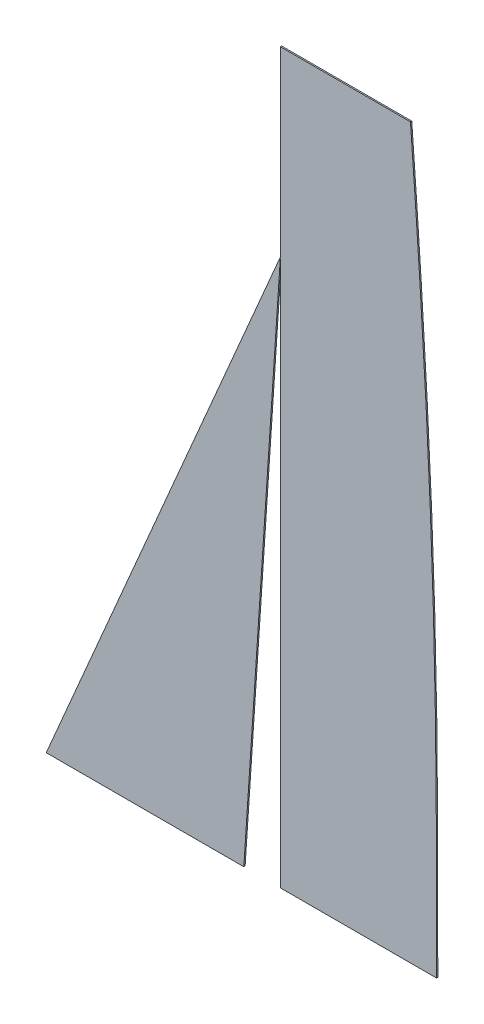
ISO-10303-21;
HEADER;
FILE_DESCRIPTION(('STEP AP214'),'2;1');
FILE_NAME('part.step','',(''),(''),'','','');
FILE_SCHEMA(('AUTOMOTIVE_DESIGN { 1 0 10303 214 1 1 1 1 }'));
ENDSEC;
DATA;
#1=APPLICATION_CONTEXT('core data for automotive mechanical design processes');
#2=APPLICATION_PROTOCOL_DEFINITION('international standard','automotive_design',2000,#1);
#3=PRODUCT_CONTEXT('',#1,'mechanical');
#4=PRODUCT('Part','Part','',(#3));
#5=PRODUCT_RELATED_PRODUCT_CATEGORY('part','',(#4));
#6=PRODUCT_DEFINITION_FORMATION('','',#4);
#7=PRODUCT_DEFINITION_CONTEXT('part definition',#1,'design');
#8=PRODUCT_DEFINITION('design','',#6,#7);
#9=PRODUCT_DEFINITION_SHAPE('','',#8);
#10=(LENGTH_UNIT() NAMED_UNIT(*) SI_UNIT(.MILLI.,.METRE.));
#11=(NAMED_UNIT(*) PLANE_ANGLE_UNIT() SI_UNIT($,.RADIAN.));
#12=(NAMED_UNIT(*) SI_UNIT($,.STERADIAN.) SOLID_ANGLE_UNIT());
#13=UNCERTAINTY_MEASURE_WITH_UNIT(LENGTH_MEASURE(1.E-05),#10,'distance_accuracy_value','');
#14=(GEOMETRIC_REPRESENTATION_CONTEXT(3) GLOBAL_UNCERTAINTY_ASSIGNED_CONTEXT((#13)) GLOBAL_UNIT_ASSIGNED_CONTEXT((#10,
#11,#12)) REPRESENTATION_CONTEXT('',''));
#15=CARTESIAN_POINT('',(0.,0.,0.));
#16=DIRECTION('',(0.,0.,1.));
#17=DIRECTION('',(1.,0.,0.));
#18=AXIS2_PLACEMENT_3D('',#15,#16,#17);
#19=CARTESIAN_POINT('',(-71.0554669763056,4.75391743362067,2.54));
#20=DIRECTION('',(0.997769391911804,-0.0667550789374777,0.));
#21=DIRECTION('',(0.0667550789374777,0.997769391911804,0.));
#22=AXIS2_PLACEMENT_3D('',#19,#20,#21);
#23=PLANE('',#22);
#24=DIRECTION('',(-0.0667550789374777,-0.997769391911804,0.));
#25=VECTOR('',#24,1.);
#26=CARTESIAN_POINT('',(-71.0554669763056,4.75391743362067,0.));
#27=LINE('',#26,#25);
#28=CARTESIAN_POINT('',(-1.3064532053304E-13,1066.8,0.));
#29=VERTEX_POINT('',#28);
#30=CARTESIAN_POINT('',(-71.373524571694,0.,0.));
#31=VERTEX_POINT('',#30);
#32=EDGE_CURVE('E95',#29,#31,#27,.T.);
#33=ORIENTED_EDGE('',*,*,#32,.F.);
#34=DIRECTION('',(0.,0.,-1.));
#35=VECTOR('',#34,1.);
#36=CARTESIAN_POINT('',(-1.3064532053304E-13,1066.8,2.54));
#37=LINE('',#36,#35);
#38=CARTESIAN_POINT('',(-1.3064532053304E-13,1066.8,2.54));
#39=VERTEX_POINT('',#38);
#40=EDGE_CURVE('E12',#39,#29,#37,.T.);
#41=ORIENTED_EDGE('',*,*,#40,.F.);
#42=DIRECTION('',(-0.0667550789374777,-0.997769391911804,0.));
#43=VECTOR('',#42,1.);
#44=CARTESIAN_POINT('',(-71.0554669763056,4.75391743362067,2.54));
#45=LINE('',#44,#43);
#46=CARTESIAN_POINT('',(-71.373524571694,0.,2.54));
#47=VERTEX_POINT('',#46);
#48=EDGE_CURVE('E93',#39,#47,#45,.T.);
#49=ORIENTED_EDGE('',*,*,#48,.T.);
#50=DIRECTION('',(0.,0.,-1.));
#51=VECTOR('',#50,1.);
#52=CARTESIAN_POINT('',(-71.373524571694,0.,2.54));
#53=LINE('',#52,#51);
#54=EDGE_CURVE('E88',#47,#31,#53,.T.);
#55=ORIENTED_EDGE('',*,*,#54,.T.);
#56=EDGE_LOOP('',(#33,#41,#49,#55));
#57=FACE_BOUND('',#56,.T.);
#58=ADVANCED_FACE('F48',(#57),#23,.T.);
#59=CARTESIAN_POINT('',(-386.255172413793,165.537931034483,2.54));
#60=DIRECTION('',(0.919145030018058,-0.393919298579168,0.));
#61=DIRECTION('',(0.393919298579168,0.919145030018058,0.));
#62=AXIS2_PLACEMENT_3D('',#59,#60,#61);
#63=PLANE('',#62);
#64=DIRECTION('',(-0.393919298579168,-0.919145030018058,0.));
#65=VECTOR('',#64,1.);
#66=CARTESIAN_POINT('',(-386.255172413793,165.537931034483,0.));
#67=LINE('',#66,#65);
#68=CARTESIAN_POINT('',(-457.2,0.,0.));
#69=VERTEX_POINT('',#68);
#70=EDGE_CURVE('E82',#29,#69,#67,.T.);
#71=ORIENTED_EDGE('',*,*,#70,.T.);
#72=DIRECTION('',(0.,0.,-1.));
#73=VECTOR('',#72,1.);
#74=CARTESIAN_POINT('',(-457.2,0.,2.54));
#75=LINE('',#74,#73);
#76=CARTESIAN_POINT('',(-457.2,0.,2.54));
#77=VERTEX_POINT('',#76);
#78=EDGE_CURVE('E57',#77,#69,#75,.T.);
#79=ORIENTED_EDGE('',*,*,#78,.F.);
#80=DIRECTION('',(-0.393919298579168,-0.919145030018058,0.));
#81=VECTOR('',#80,1.);
#82=CARTESIAN_POINT('',(-386.255172413793,165.537931034483,2.54));
#83=LINE('',#82,#81);
#84=EDGE_CURVE('E96',#39,#77,#83,.T.);
#85=ORIENTED_EDGE('',*,*,#84,.F.);
#86=ORIENTED_EDGE('',*,*,#40,.T.);
#87=EDGE_LOOP('',(#71,#79,#85,#86));
#88=FACE_BOUND('',#87,.T.);
#89=ADVANCED_FACE('F97',(#88),#63,.F.);
#90=CARTESIAN_POINT('',(0.,0.,2.54));
#91=DIRECTION('',(0.,1.,0.));
#92=DIRECTION('',(0.,0.,1.));
#93=AXIS2_PLACEMENT_3D('',#90,#91,#92);
#94=PLANE('',#93);
#95=DIRECTION('',(1.,0.,0.));
#96=VECTOR('',#95,1.);
#97=CARTESIAN_POINT('',(0.,0.,0.));
#98=LINE('',#97,#96);
#99=EDGE_CURVE('E102',#69,#31,#98,.T.);
#100=ORIENTED_EDGE('',*,*,#99,.T.);
#101=ORIENTED_EDGE('',*,*,#54,.F.);
#102=DIRECTION('',(1.,0.,0.));
#103=VECTOR('',#102,1.);
#104=CARTESIAN_POINT('',(0.,0.,2.54));
#105=LINE('',#104,#103);
#106=EDGE_CURVE('E67',#77,#47,#105,.T.);
#107=ORIENTED_EDGE('',*,*,#106,.F.);
#108=ORIENTED_EDGE('',*,*,#78,.T.);
#109=EDGE_LOOP('',(#100,#101,#107,#108));
#110=FACE_BOUND('',#109,.T.);
#111=ADVANCED_FACE('F117',(#110),#94,.F.);
#112=CARTESIAN_POINT('',(0.,0.,2.54));
#113=DIRECTION('',(0.,0.,1.));
#114=DIRECTION('',(1.,0.,0.));
#115=AXIS2_PLACEMENT_3D('',#112,#113,#114);
#116=PLANE('',#115);
#117=ORIENTED_EDGE('',*,*,#48,.F.);
#118=ORIENTED_EDGE('',*,*,#84,.T.);
#119=ORIENTED_EDGE('',*,*,#106,.T.);
#120=EDGE_LOOP('',(#117,#118,#119));
#121=FACE_BOUND('',#120,.T.);
#122=ADVANCED_FACE('F100',(#121),#116,.T.);
#123=CARTESIAN_POINT('',(0.,0.,0.));
#124=DIRECTION('',(0.,0.,1.));
#125=DIRECTION('',(1.,0.,0.));
#126=AXIS2_PLACEMENT_3D('',#123,#124,#125);
#127=PLANE('',#126);
#128=ORIENTED_EDGE('',*,*,#32,.T.);
#129=ORIENTED_EDGE('',*,*,#99,.F.);
#130=ORIENTED_EDGE('',*,*,#70,.F.);
#131=EDGE_LOOP('',(#128,#129,#130));
#132=FACE_BOUND('',#131,.T.);
#133=ADVANCED_FACE('F119',(#132),#127,.F.);
#134=CLOSED_SHELL('',(#58,#89,#111,#122,#133));
#135=MANIFOLD_SOLID_BREP('B2',#134);
#136=CARTESIAN_POINT('',(304.8,0.,2.54));
#137=DIRECTION('',(0.,1.,0.));
#138=DIRECTION('',(-1.,0.,0.));
#139=AXIS2_PLACEMENT_3D('',#136,#137,#138);
#140=PLANE('',#139);
#141=DIRECTION('',(1.,0.,0.));
#142=VECTOR('',#141,1.);
#143=CARTESIAN_POINT('',(304.8,0.,0.));
#144=LINE('',#143,#142);
#145=CARTESIAN_POINT('',(0.,0.,0.));
#146=VERTEX_POINT('',#145);
#147=CARTESIAN_POINT('',(304.8,-1.96306810425153E-13,0.));
#148=VERTEX_POINT('',#147);
#149=EDGE_CURVE('E243',#146,#148,#144,.T.);
#150=ORIENTED_EDGE('',*,*,#149,.T.);
#151=DIRECTION('',(0.,0.,-1.));
#152=VECTOR('',#151,1.);
#153=CARTESIAN_POINT('',(304.8,-1.96306810425153E-13,2.54));
#154=LINE('',#153,#152);
#155=CARTESIAN_POINT('',(304.8,-1.96306810425153E-13,2.54));
#156=VERTEX_POINT('',#155);
#157=EDGE_CURVE('E46',#156,#148,#154,.T.);
#158=ORIENTED_EDGE('',*,*,#157,.F.);
#159=DIRECTION('',(1.,0.,0.));
#160=VECTOR('',#159,1.);
#161=CARTESIAN_POINT('',(304.8,0.,2.54));
#162=LINE('',#161,#160);
#163=CARTESIAN_POINT('',(0.,0.,2.54));
#164=VERTEX_POINT('',#163);
#165=EDGE_CURVE('E223',#164,#156,#162,.T.);
#166=ORIENTED_EDGE('',*,*,#165,.F.);
#167=DIRECTION('',(0.,0.,-1.));
#168=VECTOR('',#167,1.);
#169=CARTESIAN_POINT('',(0.,0.,2.54));
#170=LINE('',#169,#168);
#171=EDGE_CURVE('E236',#164,#146,#170,.T.);
#172=ORIENTED_EDGE('',*,*,#171,.T.);
#173=EDGE_LOOP('',(#150,#158,#166,#172));
#174=FACE_BOUND('',#173,.T.);
#175=ADVANCED_FACE('F163',(#174),#140,.F.);
#176=CARTESIAN_POINT('',(304.8,-1.96306810425153E-13,2.54));
#177=CARTESIAN_POINT('',(304.8,400.693352614693,2.54));
#178=CARTESIAN_POINT('',(307.286818999843,718.686132177765,2.54));
#179=CARTESIAN_POINT('',(254.,1422.4,2.54));
#180=B_SPLINE_CURVE_WITH_KNOTS('',3,(#176,#177,#178,#179),.UNSPECIFIED.,.F.,.F.,(4,4),(0.,1.),.UNSPECIFIED.);
#181=DIRECTION('',(0.,0.,-1.));
#182=VECTOR('',#181,1.);
#183=SURFACE_OF_LINEAR_EXTRUSION('',#180,#182);
#184=CARTESIAN_POINT('',(304.8,-1.96306810425153E-13,0.));
#185=CARTESIAN_POINT('',(304.8,400.693352614693,0.));
#186=CARTESIAN_POINT('',(307.286818999843,718.686132177765,0.));
#187=CARTESIAN_POINT('',(254.,1422.4,0.));
#188=B_SPLINE_CURVE_WITH_KNOTS('',3,(#184,#185,#186,#187),.UNSPECIFIED.,.F.,.F.,(4,4),(0.,1.),.UNSPECIFIED.);
#189=CARTESIAN_POINT('',(254.,1422.4,0.));
#190=VERTEX_POINT('',#189);
#191=EDGE_CURVE('E228',#148,#190,#188,.T.);
#192=ORIENTED_EDGE('',*,*,#191,.T.);
#193=DIRECTION('',(0.,0.,-1.));
#194=VECTOR('',#193,1.);
#195=CARTESIAN_POINT('',(254.,1422.4,2.54));
#196=LINE('',#195,#194);
#197=CARTESIAN_POINT('',(254.,1422.4,2.54));
#198=VERTEX_POINT('',#197);
#199=EDGE_CURVE('E172',#198,#190,#196,.T.);
#200=ORIENTED_EDGE('',*,*,#199,.F.);
#201=EDGE_CURVE('E218',#156,#198,#180,.T.);
#202=ORIENTED_EDGE('',*,*,#201,.F.);
#203=ORIENTED_EDGE('',*,*,#157,.T.);
#204=EDGE_LOOP('',(#192,#200,#202,#203));
#205=FACE_BOUND('',#204,.T.);
#206=ADVANCED_FACE('F227',(#205),#183,.F.);
#207=CARTESIAN_POINT('',(0.,1422.4,2.54));
#208=DIRECTION('',(0.,-1.,0.));
#209=DIRECTION('',(0.,0.,-1.));
#210=AXIS2_PLACEMENT_3D('',#207,#208,#209);
#211=PLANE('',#210);
#212=DIRECTION('',(-1.,0.,0.));
#213=VECTOR('',#212,1.);
#214=CARTESIAN_POINT('',(0.,1422.4,0.));
#215=LINE('',#214,#213);
#216=CARTESIAN_POINT('',(0.,1422.4,0.));
#217=VERTEX_POINT('',#216);
#218=EDGE_CURVE('E203',#190,#217,#215,.T.);
#219=ORIENTED_EDGE('',*,*,#218,.T.);
#220=DIRECTION('',(0.,0.,-1.));
#221=VECTOR('',#220,1.);
#222=CARTESIAN_POINT('',(0.,1422.4,2.54));
#223=LINE('',#222,#221);
#224=CARTESIAN_POINT('',(0.,1422.4,2.54));
#225=VERTEX_POINT('',#224);
#226=EDGE_CURVE('E230',#225,#217,#223,.T.);
#227=ORIENTED_EDGE('',*,*,#226,.F.);
#228=DIRECTION('',(-1.,0.,0.));
#229=VECTOR('',#228,1.);
#230=CARTESIAN_POINT('',(0.,1422.4,2.54));
#231=LINE('',#230,#229);
#232=EDGE_CURVE('E221',#198,#225,#231,.T.);
#233=ORIENTED_EDGE('',*,*,#232,.F.);
#234=ORIENTED_EDGE('',*,*,#199,.T.);
#235=EDGE_LOOP('',(#219,#227,#233,#234));
#236=FACE_BOUND('',#235,.T.);
#237=ADVANCED_FACE('F231',(#236),#211,.F.);
#238=CARTESIAN_POINT('',(0.,0.,2.54));
#239=DIRECTION('',(1.,0.,0.));
#240=DIRECTION('',(0.,0.,-1.));
#241=AXIS2_PLACEMENT_3D('',#238,#239,#240);
#242=PLANE('',#241);
#243=DIRECTION('',(0.,-1.,0.));
#244=VECTOR('',#243,1.);
#245=CARTESIAN_POINT('',(0.,0.,0.));
#246=LINE('',#245,#244);
#247=EDGE_CURVE('E210',#217,#146,#246,.T.);
#248=ORIENTED_EDGE('',*,*,#247,.T.);
#249=ORIENTED_EDGE('',*,*,#171,.F.);
#250=DIRECTION('',(0.,-1.,0.));
#251=VECTOR('',#250,1.);
#252=CARTESIAN_POINT('',(0.,0.,2.54));
#253=LINE('',#252,#251);
#254=EDGE_CURVE('E183',#225,#164,#253,.T.);
#255=ORIENTED_EDGE('',*,*,#254,.F.);
#256=ORIENTED_EDGE('',*,*,#226,.T.);
#257=EDGE_LOOP('',(#248,#249,#255,#256));
#258=FACE_BOUND('',#257,.T.);
#259=ADVANCED_FACE('F260',(#258),#242,.F.);
#260=CARTESIAN_POINT('',(299.382557124941,597.567306797172,2.54));
#261=DIRECTION('',(0.,0.,1.));
#262=DIRECTION('',(1.,0.,0.));
#263=AXIS2_PLACEMENT_3D('',#260,#261,#262);
#264=PLANE('',#263);
#265=ORIENTED_EDGE('',*,*,#165,.T.);
#266=ORIENTED_EDGE('',*,*,#201,.T.);
#267=ORIENTED_EDGE('',*,*,#232,.T.);
#268=ORIENTED_EDGE('',*,*,#254,.T.);
#269=EDGE_LOOP('',(#265,#266,#267,#268));
#270=FACE_BOUND('',#269,.T.);
#271=ADVANCED_FACE('F219',(#270),#264,.T.);
#272=CARTESIAN_POINT('',(299.382557124941,597.567306797172,0.));
#273=DIRECTION('',(0.,0.,1.));
#274=DIRECTION('',(1.,0.,0.));
#275=AXIS2_PLACEMENT_3D('',#272,#273,#274);
#276=PLANE('',#275);
#277=ORIENTED_EDGE('',*,*,#149,.F.);
#278=ORIENTED_EDGE('',*,*,#247,.F.);
#279=ORIENTED_EDGE('',*,*,#218,.F.);
#280=ORIENTED_EDGE('',*,*,#191,.F.);
#281=EDGE_LOOP('',(#277,#278,#279,#280));
#282=FACE_BOUND('',#281,.T.);
#283=ADVANCED_FACE('F263',(#282),#276,.F.);
#284=CLOSED_SHELL('',(#175,#206,#237,#259,#271,#283));
#285=MANIFOLD_SOLID_BREP('B6',#284);
#286=ADVANCED_BREP_SHAPE_REPRESENTATION('',(#18,#135,#285),#14);
#287=SHAPE_DEFINITION_REPRESENTATION(#9,#286);
ENDSEC;
END-ISO-10303-21;
